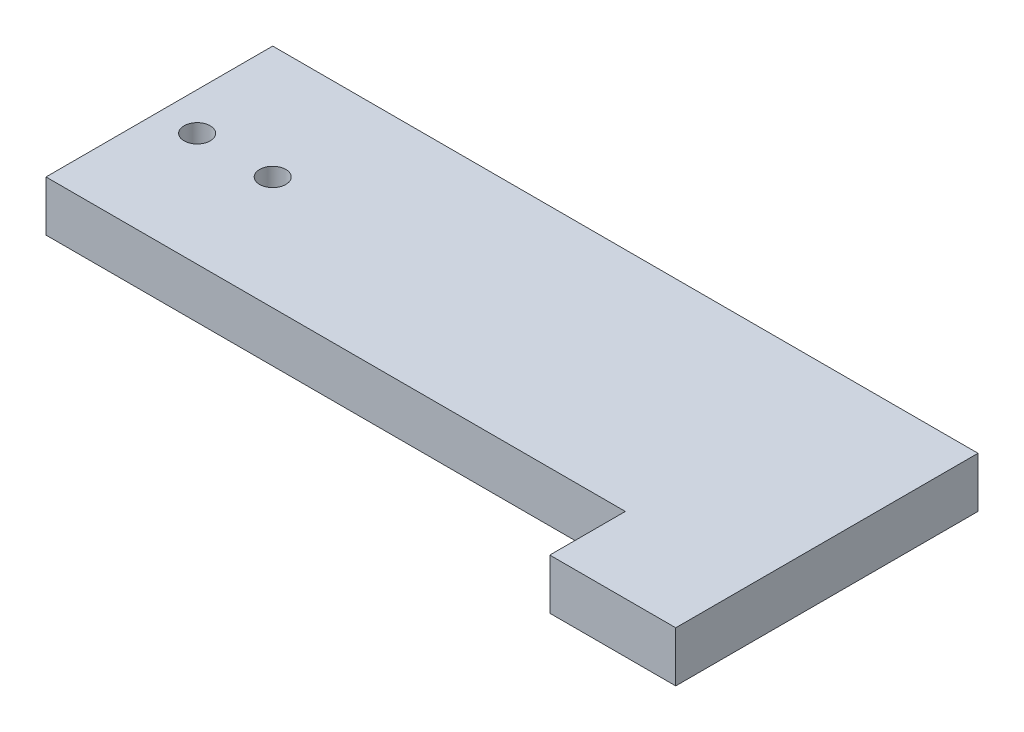
ISO-10303-21;
HEADER;
FILE_DESCRIPTION(('STEP AP214'),'2;1');
FILE_NAME('part.step','',(''),(''),'','','');
FILE_SCHEMA(('AUTOMOTIVE_DESIGN { 1 0 10303 214 1 1 1 1 }'));
ENDSEC;
DATA;
#1=APPLICATION_CONTEXT('core data for automotive mechanical design processes');
#2=APPLICATION_PROTOCOL_DEFINITION('international standard','automotive_design',2000,#1);
#3=PRODUCT_CONTEXT('',#1,'mechanical');
#4=PRODUCT('Part','Part','',(#3));
#5=PRODUCT_RELATED_PRODUCT_CATEGORY('part','',(#4));
#6=PRODUCT_DEFINITION_FORMATION('','',#4);
#7=PRODUCT_DEFINITION_CONTEXT('part definition',#1,'design');
#8=PRODUCT_DEFINITION('design','',#6,#7);
#9=PRODUCT_DEFINITION_SHAPE('','',#8);
#10=(LENGTH_UNIT() NAMED_UNIT(*) SI_UNIT(.MILLI.,.METRE.));
#11=(NAMED_UNIT(*) PLANE_ANGLE_UNIT() SI_UNIT($,.RADIAN.));
#12=(NAMED_UNIT(*) SI_UNIT($,.STERADIAN.) SOLID_ANGLE_UNIT());
#13=UNCERTAINTY_MEASURE_WITH_UNIT(LENGTH_MEASURE(1.E-05),#10,'distance_accuracy_value','');
#14=(GEOMETRIC_REPRESENTATION_CONTEXT(3) GLOBAL_UNCERTAINTY_ASSIGNED_CONTEXT((#13)) GLOBAL_UNIT_ASSIGNED_CONTEXT((#10,
#11,#12)) REPRESENTATION_CONTEXT('',''));
#15=CARTESIAN_POINT('',(0.,0.,0.));
#16=DIRECTION('',(0.,0.,1.));
#17=DIRECTION('',(1.,0.,0.));
#18=AXIS2_PLACEMENT_3D('',#15,#16,#17);
#19=CARTESIAN_POINT('',(-44.45,3.175,14.2875));
#20=DIRECTION('',(1.,0.,0.));
#21=DIRECTION('',(0.,0.,-1.));
#22=AXIS2_PLACEMENT_3D('',#19,#20,#21);
#23=PLANE('',#22);
#24=DIRECTION('',(0.,0.,1.));
#25=VECTOR('',#24,1.);
#26=CARTESIAN_POINT('',(-44.45,-3.175,14.2875));
#27=LINE('',#26,#25);
#28=CARTESIAN_POINT('',(-44.45,-3.175,-14.2875));
#29=VERTEX_POINT('',#28);
#30=CARTESIAN_POINT('',(-44.45,-3.175,14.2875));
#31=VERTEX_POINT('',#30);
#32=EDGE_CURVE('E118',#29,#31,#27,.T.);
#33=ORIENTED_EDGE('',*,*,#32,.T.);
#34=DIRECTION('',(0.,-1.,0.));
#35=VECTOR('',#34,1.);
#36=CARTESIAN_POINT('',(-44.45,3.175,14.2875));
#37=LINE('',#36,#35);
#38=CARTESIAN_POINT('',(-44.45,3.175,14.2875));
#39=VERTEX_POINT('',#38);
#40=EDGE_CURVE('E11',#39,#31,#37,.T.);
#41=ORIENTED_EDGE('',*,*,#40,.F.);
#42=DIRECTION('',(0.,0.,1.));
#43=VECTOR('',#42,1.);
#44=CARTESIAN_POINT('',(-44.45,3.175,14.2875));
#45=LINE('',#44,#43);
#46=CARTESIAN_POINT('',(-44.45,3.175,-14.2875));
#47=VERTEX_POINT('',#46);
#48=EDGE_CURVE('E129',#47,#39,#45,.T.);
#49=ORIENTED_EDGE('',*,*,#48,.F.);
#50=DIRECTION('',(0.,-1.,0.));
#51=VECTOR('',#50,1.);
#52=CARTESIAN_POINT('',(-44.45,3.175,-14.2875));
#53=LINE('',#52,#51);
#54=EDGE_CURVE('E114',#47,#29,#53,.T.);
#55=ORIENTED_EDGE('',*,*,#54,.T.);
#56=EDGE_LOOP('',(#33,#41,#49,#55));
#57=FACE_BOUND('',#56,.T.);
#58=ADVANCED_FACE('F34',(#57),#23,.F.);
#59=CARTESIAN_POINT('',(28.575,3.175,14.2875));
#60=DIRECTION('',(0.,0.,-1.));
#61=DIRECTION('',(-1.,0.,0.));
#62=AXIS2_PLACEMENT_3D('',#59,#60,#61);
#63=PLANE('',#62);
#64=DIRECTION('',(1.,0.,0.));
#65=VECTOR('',#64,1.);
#66=CARTESIAN_POINT('',(28.575,-3.175,14.2875));
#67=LINE('',#66,#65);
#68=CARTESIAN_POINT('',(28.575,-3.175,14.2875));
#69=VERTEX_POINT('',#68);
#70=EDGE_CURVE('E121',#31,#69,#67,.T.);
#71=ORIENTED_EDGE('',*,*,#70,.T.);
#72=DIRECTION('',(0.,-1.,0.));
#73=VECTOR('',#72,1.);
#74=CARTESIAN_POINT('',(28.575,3.175,14.2875));
#75=LINE('',#74,#73);
#76=CARTESIAN_POINT('',(28.575,3.175,14.2875));
#77=VERTEX_POINT('',#76);
#78=EDGE_CURVE('E42',#77,#69,#75,.T.);
#79=ORIENTED_EDGE('',*,*,#78,.F.);
#80=DIRECTION('',(1.,0.,0.));
#81=VECTOR('',#80,1.);
#82=CARTESIAN_POINT('',(28.575,3.175,14.2875));
#83=LINE('',#82,#81);
#84=EDGE_CURVE('E86',#39,#77,#83,.T.);
#85=ORIENTED_EDGE('',*,*,#84,.F.);
#86=ORIENTED_EDGE('',*,*,#40,.T.);
#87=EDGE_LOOP('',(#71,#79,#85,#86));
#88=FACE_BOUND('',#87,.T.);
#89=ADVANCED_FACE('F154',(#88),#63,.F.);
#90=CARTESIAN_POINT('',(28.575,3.175,14.2875));
#91=DIRECTION('',(1.,0.,0.));
#92=DIRECTION('',(0.,0.,-1.));
#93=AXIS2_PLACEMENT_3D('',#90,#91,#92);
#94=PLANE('',#93);
#95=DIRECTION('',(0.,0.,1.));
#96=VECTOR('',#95,1.);
#97=CARTESIAN_POINT('',(28.575,-3.175,14.2875));
#98=LINE('',#97,#96);
#99=CARTESIAN_POINT('',(28.575,-3.175,23.8125));
#100=VERTEX_POINT('',#99);
#101=EDGE_CURVE('E124',#69,#100,#98,.T.);
#102=ORIENTED_EDGE('',*,*,#101,.T.);
#103=DIRECTION('',(0.,-1.,0.));
#104=VECTOR('',#103,1.);
#105=CARTESIAN_POINT('',(28.575,3.175,23.8125));
#106=LINE('',#105,#104);
#107=CARTESIAN_POINT('',(28.575,3.175,23.8125));
#108=VERTEX_POINT('',#107);
#109=EDGE_CURVE('E109',#108,#100,#106,.T.);
#110=ORIENTED_EDGE('',*,*,#109,.F.);
#111=DIRECTION('',(0.,0.,1.));
#112=VECTOR('',#111,1.);
#113=CARTESIAN_POINT('',(28.575,3.175,14.2875));
#114=LINE('',#113,#112);
#115=EDGE_CURVE('E99',#77,#108,#114,.T.);
#116=ORIENTED_EDGE('',*,*,#115,.F.);
#117=ORIENTED_EDGE('',*,*,#78,.T.);
#118=EDGE_LOOP('',(#102,#110,#116,#117));
#119=FACE_BOUND('',#118,.T.);
#120=ADVANCED_FACE('F135',(#119),#94,.F.);
#121=CARTESIAN_POINT('',(28.575,3.175,23.8125));
#122=DIRECTION('',(0.,0.,-1.));
#123=DIRECTION('',(-1.,0.,0.));
#124=AXIS2_PLACEMENT_3D('',#121,#122,#123);
#125=PLANE('',#124);
#126=DIRECTION('',(1.,0.,0.));
#127=VECTOR('',#126,1.);
#128=CARTESIAN_POINT('',(28.575,-3.175,23.8125));
#129=LINE('',#128,#127);
#130=CARTESIAN_POINT('',(44.45,-3.175,23.8125));
#131=VERTEX_POINT('',#130);
#132=EDGE_CURVE('E108',#100,#131,#129,.T.);
#133=ORIENTED_EDGE('',*,*,#132,.T.);
#134=DIRECTION('',(0.,-1.,0.));
#135=VECTOR('',#134,1.);
#136=CARTESIAN_POINT('',(44.45,3.175,23.8125));
#137=LINE('',#136,#135);
#138=CARTESIAN_POINT('',(44.45,3.175,23.8125));
#139=VERTEX_POINT('',#138);
#140=EDGE_CURVE('E105',#139,#131,#137,.T.);
#141=ORIENTED_EDGE('',*,*,#140,.F.);
#142=DIRECTION('',(1.,0.,0.));
#143=VECTOR('',#142,1.);
#144=CARTESIAN_POINT('',(28.575,3.175,23.8125));
#145=LINE('',#144,#143);
#146=EDGE_CURVE('E93',#108,#139,#145,.T.);
#147=ORIENTED_EDGE('',*,*,#146,.F.);
#148=ORIENTED_EDGE('',*,*,#109,.T.);
#149=EDGE_LOOP('',(#133,#141,#147,#148));
#150=FACE_BOUND('',#149,.T.);
#151=ADVANCED_FACE('F106',(#150),#125,.F.);
#152=CARTESIAN_POINT('',(44.45,3.175,14.2875));
#153=DIRECTION('',(-1.,0.,0.));
#154=DIRECTION('',(0.,0.,1.));
#155=AXIS2_PLACEMENT_3D('',#152,#153,#154);
#156=PLANE('',#155);
#157=DIRECTION('',(0.,0.,-1.));
#158=VECTOR('',#157,1.);
#159=CARTESIAN_POINT('',(44.45,-3.175,14.2875));
#160=LINE('',#159,#158);
#161=CARTESIAN_POINT('',(44.45,-3.175,-14.2875));
#162=VERTEX_POINT('',#161);
#163=EDGE_CURVE('E72',#131,#162,#160,.T.);
#164=ORIENTED_EDGE('',*,*,#163,.T.);
#165=DIRECTION('',(0.,-1.,0.));
#166=VECTOR('',#165,1.);
#167=CARTESIAN_POINT('',(44.45,3.175,-14.2875));
#168=LINE('',#167,#166);
#169=CARTESIAN_POINT('',(44.45,3.175,-14.2875));
#170=VERTEX_POINT('',#169);
#171=EDGE_CURVE('E110',#170,#162,#168,.T.);
#172=ORIENTED_EDGE('',*,*,#171,.F.);
#173=DIRECTION('',(0.,0.,-1.));
#174=VECTOR('',#173,1.);
#175=CARTESIAN_POINT('',(44.45,3.175,23.8125));
#176=LINE('',#175,#174);
#177=EDGE_CURVE('E97',#139,#170,#176,.T.);
#178=ORIENTED_EDGE('',*,*,#177,.F.);
#179=ORIENTED_EDGE('',*,*,#140,.T.);
#180=EDGE_LOOP('',(#164,#172,#178,#179));
#181=FACE_BOUND('',#180,.T.);
#182=ADVANCED_FACE('F112',(#181),#156,.F.);
#183=CARTESIAN_POINT('',(44.45,3.175,-14.2875));
#184=DIRECTION('',(0.,0.,1.));
#185=DIRECTION('',(1.,0.,0.));
#186=AXIS2_PLACEMENT_3D('',#183,#184,#185);
#187=PLANE('',#186);
#188=DIRECTION('',(-1.,0.,0.));
#189=VECTOR('',#188,1.);
#190=CARTESIAN_POINT('',(44.45,-3.175,-14.2875));
#191=LINE('',#190,#189);
#192=EDGE_CURVE('E78',#162,#29,#191,.T.);
#193=ORIENTED_EDGE('',*,*,#192,.T.);
#194=ORIENTED_EDGE('',*,*,#54,.F.);
#195=DIRECTION('',(-1.,0.,0.));
#196=VECTOR('',#195,1.);
#197=CARTESIAN_POINT('',(44.45,3.175,-14.2875));
#198=LINE('',#197,#196);
#199=EDGE_CURVE('E50',#170,#47,#198,.T.);
#200=ORIENTED_EDGE('',*,*,#199,.F.);
#201=ORIENTED_EDGE('',*,*,#171,.T.);
#202=EDGE_LOOP('',(#193,#194,#200,#201));
#203=FACE_BOUND('',#202,.T.);
#204=ADVANCED_FACE('F142',(#203),#187,.F.);
#205=CARTESIAN_POINT('',(0.,3.175,0.));
#206=DIRECTION('',(0.,1.,0.));
#207=DIRECTION('',(0.,0.,1.));
#208=AXIS2_PLACEMENT_3D('',#205,#206,#207);
#209=PLANE('',#208);
#210=CARTESIAN_POINT('',(-39.6875,3.175,0.));
#211=DIRECTION('',(0.,1.,0.));
#212=DIRECTION('',(0.,0.,1.));
#213=AXIS2_PLACEMENT_3D('',#210,#211,#212);
#214=CIRCLE('',#213,1.651);
#215=CARTESIAN_POINT('',(-39.6875,3.175,1.65099999999999));
#216=VERTEX_POINT('',#215);
#217=EDGE_CURVE('E220',#216,#216,#214,.T.);
#218=ORIENTED_EDGE('',*,*,#217,.F.);
#219=EDGE_LOOP('',(#218));
#220=FACE_BOUND('',#219,.T.);
#221=CARTESIAN_POINT('',(-30.1625,3.175,0.));
#222=DIRECTION('',(0.,1.,0.));
#223=DIRECTION('',(0.,0.,1.));
#224=AXIS2_PLACEMENT_3D('',#221,#222,#223);
#225=CIRCLE('',#224,1.651);
#226=CARTESIAN_POINT('',(-30.1625,3.175,1.65099999999999));
#227=VERTEX_POINT('',#226);
#228=EDGE_CURVE('E225',#227,#227,#225,.T.);
#229=ORIENTED_EDGE('',*,*,#228,.F.);
#230=EDGE_LOOP('',(#229));
#231=FACE_BOUND('',#230,.T.);
#232=ORIENTED_EDGE('',*,*,#48,.T.);
#233=ORIENTED_EDGE('',*,*,#84,.T.);
#234=ORIENTED_EDGE('',*,*,#115,.T.);
#235=ORIENTED_EDGE('',*,*,#146,.T.);
#236=ORIENTED_EDGE('',*,*,#177,.T.);
#237=ORIENTED_EDGE('',*,*,#199,.T.);
#238=EDGE_LOOP('',(#232,#233,#234,#235,#236,#237));
#239=FACE_BOUND('',#238,.T.);
#240=ADVANCED_FACE('F95',(#220,#231,#239),#209,.T.);
#241=CARTESIAN_POINT('',(0.,-3.175,0.));
#242=DIRECTION('',(0.,1.,0.));
#243=DIRECTION('',(0.,0.,1.));
#244=AXIS2_PLACEMENT_3D('',#241,#242,#243);
#245=PLANE('',#244);
#246=CARTESIAN_POINT('',(-39.6875,-3.175,0.));
#247=DIRECTION('',(0.,1.,0.));
#248=DIRECTION('',(0.,0.,1.));
#249=AXIS2_PLACEMENT_3D('',#246,#247,#248);
#250=CIRCLE('',#249,1.651);
#251=CARTESIAN_POINT('',(-39.6875,-3.175,1.65099999999999));
#252=VERTEX_POINT('',#251);
#253=EDGE_CURVE('E122',#252,#252,#250,.T.);
#254=ORIENTED_EDGE('',*,*,#253,.T.);
#255=EDGE_LOOP('',(#254));
#256=FACE_BOUND('',#255,.T.);
#257=CARTESIAN_POINT('',(-30.1625,-3.175,0.));
#258=DIRECTION('',(0.,1.,0.));
#259=DIRECTION('',(0.,0.,1.));
#260=AXIS2_PLACEMENT_3D('',#257,#258,#259);
#261=CIRCLE('',#260,1.651);
#262=CARTESIAN_POINT('',(-30.1625,-3.175,1.65099999999999));
#263=VERTEX_POINT('',#262);
#264=EDGE_CURVE('E221',#263,#263,#261,.T.);
#265=ORIENTED_EDGE('',*,*,#264,.T.);
#266=EDGE_LOOP('',(#265));
#267=FACE_BOUND('',#266,.T.);
#268=ORIENTED_EDGE('',*,*,#32,.F.);
#269=ORIENTED_EDGE('',*,*,#192,.F.);
#270=ORIENTED_EDGE('',*,*,#163,.F.);
#271=ORIENTED_EDGE('',*,*,#132,.F.);
#272=ORIENTED_EDGE('',*,*,#101,.F.);
#273=ORIENTED_EDGE('',*,*,#70,.F.);
#274=EDGE_LOOP('',(#268,#269,#270,#271,#272,#273));
#275=FACE_BOUND('',#274,.T.);
#276=ADVANCED_FACE('F138',(#256,#267,#275),#245,.F.);
#277=CARTESIAN_POINT('',(-30.1625,-3.175,0.));
#278=DIRECTION('',(0.,1.,0.));
#279=DIRECTION('',(0.,0.,1.));
#280=AXIS2_PLACEMENT_3D('',#277,#278,#279);
#281=CYLINDRICAL_SURFACE('',#280,1.651);
#282=ORIENTED_EDGE('',*,*,#264,.F.);
#283=EDGE_LOOP('',(#282));
#284=FACE_BOUND('',#283,.T.);
#285=ORIENTED_EDGE('',*,*,#228,.T.);
#286=EDGE_LOOP('',(#285));
#287=FACE_BOUND('',#286,.T.);
#288=ADVANCED_FACE('F192',(#284,#287),#281,.F.);
#289=CARTESIAN_POINT('',(-39.6875,-3.175,0.));
#290=DIRECTION('',(0.,1.,0.));
#291=DIRECTION('',(0.,0.,1.));
#292=AXIS2_PLACEMENT_3D('',#289,#290,#291);
#293=CYLINDRICAL_SURFACE('',#292,1.651);
#294=ORIENTED_EDGE('',*,*,#253,.F.);
#295=EDGE_LOOP('',(#294));
#296=FACE_BOUND('',#295,.T.);
#297=ORIENTED_EDGE('',*,*,#217,.T.);
#298=EDGE_LOOP('',(#297));
#299=FACE_BOUND('',#298,.T.);
#300=ADVANCED_FACE('F201',(#296,#299),#293,.F.);
#301=CLOSED_SHELL('',(#58,#89,#120,#151,#182,#204,#240,#276,#288,#300));
#302=MANIFOLD_SOLID_BREP('B2',#301);
#303=ADVANCED_BREP_SHAPE_REPRESENTATION('',(#18,#302),#14);
#304=SHAPE_DEFINITION_REPRESENTATION(#9,#303);
ENDSEC;
END-ISO-10303-21;
